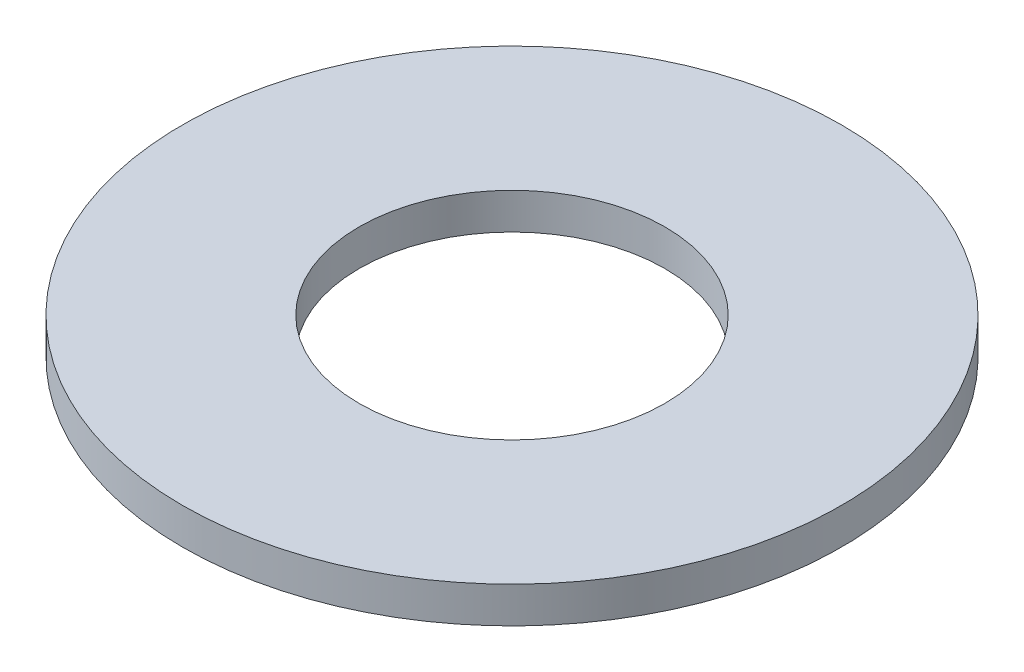
ISO-10303-21;
HEADER;
FILE_DESCRIPTION(('STEP AP214'),'2;1');
FILE_NAME('part.step','',(''),(''),'','','');
FILE_SCHEMA(('AUTOMOTIVE_DESIGN { 1 0 10303 214 1 1 1 1 }'));
ENDSEC;
DATA;
#1=APPLICATION_CONTEXT('core data for automotive mechanical design processes');
#2=APPLICATION_PROTOCOL_DEFINITION('international standard','automotive_design',2000,#1);
#3=PRODUCT_CONTEXT('',#1,'mechanical');
#4=PRODUCT('Part','Part','',(#3));
#5=PRODUCT_RELATED_PRODUCT_CATEGORY('part','',(#4));
#6=PRODUCT_DEFINITION_FORMATION('','',#4);
#7=PRODUCT_DEFINITION_CONTEXT('part definition',#1,'design');
#8=PRODUCT_DEFINITION('design','',#6,#7);
#9=PRODUCT_DEFINITION_SHAPE('','',#8);
#10=(LENGTH_UNIT() NAMED_UNIT(*) SI_UNIT(.MILLI.,.METRE.));
#11=(NAMED_UNIT(*) PLANE_ANGLE_UNIT() SI_UNIT($,.RADIAN.));
#12=(NAMED_UNIT(*) SI_UNIT($,.STERADIAN.) SOLID_ANGLE_UNIT());
#13=UNCERTAINTY_MEASURE_WITH_UNIT(LENGTH_MEASURE(1.E-05),#10,'distance_accuracy_value','');
#14=(GEOMETRIC_REPRESENTATION_CONTEXT(3) GLOBAL_UNCERTAINTY_ASSIGNED_CONTEXT((#13)) GLOBAL_UNIT_ASSIGNED_CONTEXT((#10,
#11,#12)) REPRESENTATION_CONTEXT('',''));
#15=CARTESIAN_POINT('',(0.,0.,0.));
#16=DIRECTION('',(0.,0.,1.));
#17=DIRECTION('',(1.,0.,0.));
#18=AXIS2_PLACEMENT_3D('',#15,#16,#17);
#19=CARTESIAN_POINT('',(0.,0.6096,0.));
#20=DIRECTION('',(0.,-1.,0.));
#21=DIRECTION('',(0.,0.,-1.));
#22=AXIS2_PLACEMENT_3D('',#19,#20,#21);
#23=CYLINDRICAL_SURFACE('',#22,5.55625);
#24=CARTESIAN_POINT('',(0.,0.6096,0.));
#25=DIRECTION('',(0.,1.,0.));
#26=DIRECTION('',(0.,0.,1.));
#27=AXIS2_PLACEMENT_3D('',#24,#25,#26);
#28=CIRCLE('',#27,5.55625);
#29=CARTESIAN_POINT('',(0.,0.6096,5.55625));
#30=VERTEX_POINT('',#29);
#31=EDGE_CURVE('E10',#30,#30,#28,.T.);
#32=ORIENTED_EDGE('',*,*,#31,.F.);
#33=EDGE_LOOP('',(#32));
#34=FACE_BOUND('',#33,.T.);
#35=CARTESIAN_POINT('',(0.,0.,0.));
#36=DIRECTION('',(0.,1.,0.));
#37=DIRECTION('',(0.,0.,1.));
#38=AXIS2_PLACEMENT_3D('',#35,#36,#37);
#39=CIRCLE('',#38,5.55625);
#40=CARTESIAN_POINT('',(0.,0.,5.55625));
#41=VERTEX_POINT('',#40);
#42=EDGE_CURVE('E33',#41,#41,#39,.T.);
#43=ORIENTED_EDGE('',*,*,#42,.T.);
#44=EDGE_LOOP('',(#43));
#45=FACE_BOUND('',#44,.T.);
#46=ADVANCED_FACE('F30',(#34,#45),#23,.T.);
#47=CARTESIAN_POINT('',(0.,0.6096,0.));
#48=DIRECTION('',(0.,1.,0.));
#49=DIRECTION('',(0.,0.,1.));
#50=AXIS2_PLACEMENT_3D('',#47,#48,#49);
#51=PLANE('',#50);
#52=CARTESIAN_POINT('',(0.,0.6096,0.));
#53=DIRECTION('',(0.,1.,0.));
#54=DIRECTION('',(0.,0.,1.));
#55=AXIS2_PLACEMENT_3D('',#52,#53,#54);
#56=CIRCLE('',#55,2.5781);
#57=CARTESIAN_POINT('',(0.,0.6096,2.5781));
#58=VERTEX_POINT('',#57);
#59=EDGE_CURVE('E42',#58,#58,#56,.T.);
#60=ORIENTED_EDGE('',*,*,#59,.F.);
#61=EDGE_LOOP('',(#60));
#62=FACE_BOUND('',#61,.T.);
#63=ORIENTED_EDGE('',*,*,#31,.T.);
#64=EDGE_LOOP('',(#63));
#65=FACE_BOUND('',#64,.T.);
#66=ADVANCED_FACE('F57',(#62,#65),#51,.T.);
#67=CARTESIAN_POINT('',(0.,0.,0.));
#68=DIRECTION('',(0.,1.,0.));
#69=DIRECTION('',(0.,0.,1.));
#70=AXIS2_PLACEMENT_3D('',#67,#68,#69);
#71=PLANE('',#70);
#72=CARTESIAN_POINT('',(0.,0.,0.));
#73=DIRECTION('',(0.,1.,0.));
#74=DIRECTION('',(0.,0.,1.));
#75=AXIS2_PLACEMENT_3D('',#72,#73,#74);
#76=CIRCLE('',#75,2.5781);
#77=CARTESIAN_POINT('',(0.,0.,2.5781));
#78=VERTEX_POINT('',#77);
#79=EDGE_CURVE('E40',#78,#78,#76,.T.);
#80=ORIENTED_EDGE('',*,*,#79,.T.);
#81=EDGE_LOOP('',(#80));
#82=FACE_BOUND('',#81,.T.);
#83=ORIENTED_EDGE('',*,*,#42,.F.);
#84=EDGE_LOOP('',(#83));
#85=FACE_BOUND('',#84,.T.);
#86=ADVANCED_FACE('F48',(#82,#85),#71,.F.);
#87=CARTESIAN_POINT('',(0.,0.,0.));
#88=DIRECTION('',(0.,1.,0.));
#89=DIRECTION('',(0.,0.,1.));
#90=AXIS2_PLACEMENT_3D('',#87,#88,#89);
#91=CYLINDRICAL_SURFACE('',#90,2.5781);
#92=ORIENTED_EDGE('',*,*,#79,.F.);
#93=EDGE_LOOP('',(#92));
#94=FACE_BOUND('',#93,.T.);
#95=ORIENTED_EDGE('',*,*,#59,.T.);
#96=EDGE_LOOP('',(#95));
#97=FACE_BOUND('',#96,.T.);
#98=ADVANCED_FACE('F51',(#94,#97),#91,.F.);
#99=CLOSED_SHELL('',(#46,#66,#86,#98));
#100=MANIFOLD_SOLID_BREP('B2',#99);
#101=ADVANCED_BREP_SHAPE_REPRESENTATION('',(#18,#100),#14);
#102=SHAPE_DEFINITION_REPRESENTATION(#9,#101);
ENDSEC;
END-ISO-10303-21;
